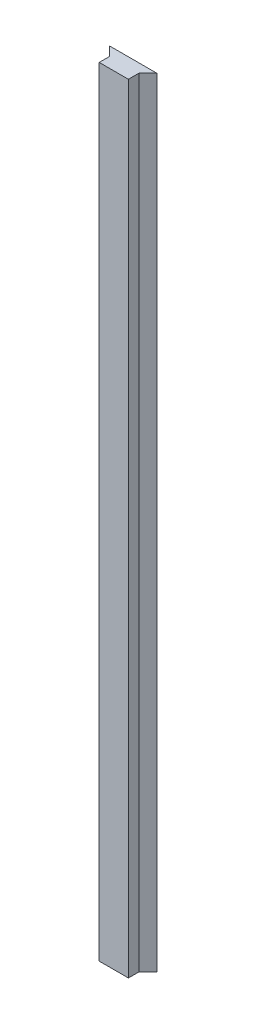
ISO-10303-21;
HEADER;
FILE_DESCRIPTION(('STEP AP214'),'2;1');
FILE_NAME('part.step','',(''),(''),'','','');
FILE_SCHEMA(('AUTOMOTIVE_DESIGN { 1 0 10303 214 1 1 1 1 }'));
ENDSEC;
DATA;
#1=APPLICATION_CONTEXT('core data for automotive mechanical design processes');
#2=APPLICATION_PROTOCOL_DEFINITION('international standard','automotive_design',2000,#1);
#3=PRODUCT_CONTEXT('',#1,'mechanical');
#4=PRODUCT('Part','Part','',(#3));
#5=PRODUCT_RELATED_PRODUCT_CATEGORY('part','',(#4));
#6=PRODUCT_DEFINITION_FORMATION('','',#4);
#7=PRODUCT_DEFINITION_CONTEXT('part definition',#1,'design');
#8=PRODUCT_DEFINITION('design','',#6,#7);
#9=PRODUCT_DEFINITION_SHAPE('','',#8);
#10=(LENGTH_UNIT() NAMED_UNIT(*) SI_UNIT(.MILLI.,.METRE.));
#11=(NAMED_UNIT(*) PLANE_ANGLE_UNIT() SI_UNIT($,.RADIAN.));
#12=(NAMED_UNIT(*) SI_UNIT($,.STERADIAN.) SOLID_ANGLE_UNIT());
#13=UNCERTAINTY_MEASURE_WITH_UNIT(LENGTH_MEASURE(1.E-05),#10,'distance_accuracy_value','');
#14=(GEOMETRIC_REPRESENTATION_CONTEXT(3) GLOBAL_UNCERTAINTY_ASSIGNED_CONTEXT((#13)) GLOBAL_UNIT_ASSIGNED_CONTEXT((#10,
#11,#12)) REPRESENTATION_CONTEXT('',''));
#15=CARTESIAN_POINT('',(0.,0.,0.));
#16=DIRECTION('',(0.,0.,1.));
#17=DIRECTION('',(1.,0.,0.));
#18=AXIS2_PLACEMENT_3D('',#15,#16,#17);
#19=CARTESIAN_POINT('',(0.,508.,-6.858));
#20=DIRECTION('',(1.,0.,0.));
#21=DIRECTION('',(0.,0.,-1.));
#22=AXIS2_PLACEMENT_3D('',#19,#20,#21);
#23=PLANE('',#22);
#24=DIRECTION('',(0.,0.,1.));
#25=VECTOR('',#24,1.);
#26=CARTESIAN_POINT('',(0.,0.,-6.858));
#27=LINE('',#26,#25);
#28=CARTESIAN_POINT('',(0.,0.,-6.858));
#29=VERTEX_POINT('',#28);
#30=CARTESIAN_POINT('',(0.,0.,0.));
#31=VERTEX_POINT('',#30);
#32=EDGE_CURVE('E117',#29,#31,#27,.T.);
#33=ORIENTED_EDGE('',*,*,#32,.T.);
#34=DIRECTION('',(0.,-1.,0.));
#35=VECTOR('',#34,1.);
#36=CARTESIAN_POINT('',(0.,508.,0.));
#37=LINE('',#36,#35);
#38=CARTESIAN_POINT('',(0.,508.,0.));
#39=VERTEX_POINT('',#38);
#40=EDGE_CURVE('E11',#39,#31,#37,.T.);
#41=ORIENTED_EDGE('',*,*,#40,.F.);
#42=DIRECTION('',(0.,0.,1.));
#43=VECTOR('',#42,1.);
#44=CARTESIAN_POINT('',(0.,508.,-6.858));
#45=LINE('',#44,#43);
#46=CARTESIAN_POINT('',(0.,508.,-6.858));
#47=VERTEX_POINT('',#46);
#48=EDGE_CURVE('E127',#47,#39,#45,.T.);
#49=ORIENTED_EDGE('',*,*,#48,.F.);
#50=DIRECTION('',(0.,-1.,0.));
#51=VECTOR('',#50,1.);
#52=CARTESIAN_POINT('',(0.,508.,-6.858));
#53=LINE('',#52,#51);
#54=EDGE_CURVE('E113',#47,#29,#53,.T.);
#55=ORIENTED_EDGE('',*,*,#54,.T.);
#56=EDGE_LOOP('',(#33,#41,#49,#55));
#57=FACE_BOUND('',#56,.T.);
#58=ADVANCED_FACE('F33',(#57),#23,.F.);
#59=CARTESIAN_POINT('',(0.,508.,0.));
#60=DIRECTION('',(0.,0.,-1.));
#61=DIRECTION('',(-1.,0.,0.));
#62=AXIS2_PLACEMENT_3D('',#59,#60,#61);
#63=PLANE('',#62);
#64=DIRECTION('',(1.,0.,0.));
#65=VECTOR('',#64,1.);
#66=CARTESIAN_POINT('',(0.,0.,0.));
#67=LINE('',#66,#65);
#68=CARTESIAN_POINT('',(19.05,0.,0.));
#69=VERTEX_POINT('',#68);
#70=EDGE_CURVE('E120',#31,#69,#67,.T.);
#71=ORIENTED_EDGE('',*,*,#70,.T.);
#72=DIRECTION('',(0.,-1.,0.));
#73=VECTOR('',#72,1.);
#74=CARTESIAN_POINT('',(19.05,508.,0.));
#75=LINE('',#74,#73);
#76=CARTESIAN_POINT('',(19.05,508.,0.));
#77=VERTEX_POINT('',#76);
#78=EDGE_CURVE('E41',#77,#69,#75,.T.);
#79=ORIENTED_EDGE('',*,*,#78,.F.);
#80=DIRECTION('',(1.,0.,0.));
#81=VECTOR('',#80,1.);
#82=CARTESIAN_POINT('',(0.,508.,0.));
#83=LINE('',#82,#81);
#84=EDGE_CURVE('E86',#39,#77,#83,.T.);
#85=ORIENTED_EDGE('',*,*,#84,.F.);
#86=ORIENTED_EDGE('',*,*,#40,.T.);
#87=EDGE_LOOP('',(#71,#79,#85,#86));
#88=FACE_BOUND('',#87,.T.);
#89=ADVANCED_FACE('F151',(#88),#63,.F.);
#90=CARTESIAN_POINT('',(19.05,508.,0.));
#91=DIRECTION('',(-1.,0.,0.));
#92=DIRECTION('',(0.,0.,1.));
#93=AXIS2_PLACEMENT_3D('',#90,#91,#92);
#94=PLANE('',#93);
#95=DIRECTION('',(0.,0.,-1.));
#96=VECTOR('',#95,1.);
#97=CARTESIAN_POINT('',(19.05,0.,0.));
#98=LINE('',#97,#96);
#99=CARTESIAN_POINT('',(19.05,0.,-6.858));
#100=VERTEX_POINT('',#99);
#101=EDGE_CURVE('E122',#69,#100,#98,.T.);
#102=ORIENTED_EDGE('',*,*,#101,.T.);
#103=DIRECTION('',(0.,-1.,0.));
#104=VECTOR('',#103,1.);
#105=CARTESIAN_POINT('',(19.05,508.,-6.858));
#106=LINE('',#105,#104);
#107=CARTESIAN_POINT('',(19.05,508.,-6.858));
#108=VERTEX_POINT('',#107);
#109=EDGE_CURVE('E108',#108,#100,#106,.T.);
#110=ORIENTED_EDGE('',*,*,#109,.F.);
#111=DIRECTION('',(0.,0.,-1.));
#112=VECTOR('',#111,1.);
#113=CARTESIAN_POINT('',(19.05,508.,0.));
#114=LINE('',#113,#112);
#115=EDGE_CURVE('E99',#77,#108,#114,.T.);
#116=ORIENTED_EDGE('',*,*,#115,.F.);
#117=ORIENTED_EDGE('',*,*,#78,.T.);
#118=EDGE_LOOP('',(#102,#110,#116,#117));
#119=FACE_BOUND('',#118,.T.);
#120=ADVANCED_FACE('F133',(#119),#94,.F.);
#121=CARTESIAN_POINT('',(19.05,508.,-6.858));
#122=DIRECTION('',(-0.707106781186557,0.,-0.707106781186538));
#123=DIRECTION('',(-0.707106781186538,0.,0.707106781186557));
#124=AXIS2_PLACEMENT_3D('',#121,#122,#123);
#125=PLANE('',#124);
#126=DIRECTION('',(0.707106781186538,0.,-0.707106781186557));
#127=VECTOR('',#126,1.);
#128=CARTESIAN_POINT('',(19.05,0.,-6.858));
#129=LINE('',#128,#127);
#130=CARTESIAN_POINT('',(24.8919999999998,0.,-12.7));
#131=VERTEX_POINT('',#130);
#132=EDGE_CURVE('E107',#100,#131,#129,.T.);
#133=ORIENTED_EDGE('',*,*,#132,.T.);
#134=DIRECTION('',(0.,-1.,0.));
#135=VECTOR('',#134,1.);
#136=CARTESIAN_POINT('',(24.8919999999998,508.,-12.7));
#137=LINE('',#136,#135);
#138=CARTESIAN_POINT('',(24.8919999999998,508.,-12.7));
#139=VERTEX_POINT('',#138);
#140=EDGE_CURVE('E104',#139,#131,#137,.T.);
#141=ORIENTED_EDGE('',*,*,#140,.F.);
#142=DIRECTION('',(0.707106781186538,0.,-0.707106781186557));
#143=VECTOR('',#142,1.);
#144=CARTESIAN_POINT('',(19.05,508.,-6.858));
#145=LINE('',#144,#143);
#146=EDGE_CURVE('E93',#108,#139,#145,.T.);
#147=ORIENTED_EDGE('',*,*,#146,.F.);
#148=ORIENTED_EDGE('',*,*,#109,.T.);
#149=EDGE_LOOP('',(#133,#141,#147,#148));
#150=FACE_BOUND('',#149,.T.);
#151=ADVANCED_FACE('F105',(#150),#125,.F.);
#152=CARTESIAN_POINT('',(24.8919999999998,508.,-12.7));
#153=DIRECTION('',(0.,0.,1.));
#154=DIRECTION('',(1.,0.,0.));
#155=AXIS2_PLACEMENT_3D('',#152,#153,#154);
#156=PLANE('',#155);
#157=DIRECTION('',(-1.,0.,0.));
#158=VECTOR('',#157,1.);
#159=CARTESIAN_POINT('',(24.8919999999998,0.,-12.7));
#160=LINE('',#159,#158);
#161=CARTESIAN_POINT('',(-5.84200000000015,0.,-12.7));
#162=VERTEX_POINT('',#161);
#163=EDGE_CURVE('E72',#131,#162,#160,.T.);
#164=ORIENTED_EDGE('',*,*,#163,.T.);
#165=DIRECTION('',(0.,-1.,0.));
#166=VECTOR('',#165,1.);
#167=CARTESIAN_POINT('',(-5.84200000000015,508.,-12.7));
#168=LINE('',#167,#166);
#169=CARTESIAN_POINT('',(-5.84200000000015,508.,-12.7));
#170=VERTEX_POINT('',#169);
#171=EDGE_CURVE('E109',#170,#162,#168,.T.);
#172=ORIENTED_EDGE('',*,*,#171,.F.);
#173=DIRECTION('',(-1.,0.,0.));
#174=VECTOR('',#173,1.);
#175=CARTESIAN_POINT('',(24.8919999999998,508.,-12.7));
#176=LINE('',#175,#174);
#177=EDGE_CURVE('E97',#139,#170,#176,.T.);
#178=ORIENTED_EDGE('',*,*,#177,.F.);
#179=ORIENTED_EDGE('',*,*,#140,.T.);
#180=EDGE_LOOP('',(#164,#172,#178,#179));
#181=FACE_BOUND('',#180,.T.);
#182=ADVANCED_FACE('F111',(#181),#156,.F.);
#183=CARTESIAN_POINT('',(-5.84200000000015,508.,-12.7));
#184=DIRECTION('',(0.707106781186538,0.,-0.707106781186557));
#185=DIRECTION('',(-0.707106781186557,0.,-0.707106781186538));
#186=AXIS2_PLACEMENT_3D('',#183,#184,#185);
#187=PLANE('',#186);
#188=DIRECTION('',(0.707106781186557,0.,0.707106781186538));
#189=VECTOR('',#188,1.);
#190=CARTESIAN_POINT('',(-5.84200000000015,0.,-12.7));
#191=LINE('',#190,#189);
#192=EDGE_CURVE('E78',#162,#29,#191,.T.);
#193=ORIENTED_EDGE('',*,*,#192,.T.);
#194=ORIENTED_EDGE('',*,*,#54,.F.);
#195=DIRECTION('',(0.707106781186557,0.,0.707106781186538));
#196=VECTOR('',#195,1.);
#197=CARTESIAN_POINT('',(-5.84200000000015,508.,-12.7));
#198=LINE('',#197,#196);
#199=EDGE_CURVE('E49',#170,#47,#198,.T.);
#200=ORIENTED_EDGE('',*,*,#199,.F.);
#201=ORIENTED_EDGE('',*,*,#171,.T.);
#202=EDGE_LOOP('',(#193,#194,#200,#201));
#203=FACE_BOUND('',#202,.T.);
#204=ADVANCED_FACE('F140',(#203),#187,.F.);
#205=CARTESIAN_POINT('',(0.,508.,0.));
#206=DIRECTION('',(0.,1.,0.));
#207=DIRECTION('',(0.,0.,1.));
#208=AXIS2_PLACEMENT_3D('',#205,#206,#207);
#209=PLANE('',#208);
#210=ORIENTED_EDGE('',*,*,#48,.T.);
#211=ORIENTED_EDGE('',*,*,#84,.T.);
#212=ORIENTED_EDGE('',*,*,#115,.T.);
#213=ORIENTED_EDGE('',*,*,#146,.T.);
#214=ORIENTED_EDGE('',*,*,#177,.T.);
#215=ORIENTED_EDGE('',*,*,#199,.T.);
#216=EDGE_LOOP('',(#210,#211,#212,#213,#214,#215));
#217=FACE_BOUND('',#216,.T.);
#218=ADVANCED_FACE('F95',(#217),#209,.T.);
#219=CARTESIAN_POINT('',(0.,0.,0.));
#220=DIRECTION('',(0.,1.,0.));
#221=DIRECTION('',(0.,0.,1.));
#222=AXIS2_PLACEMENT_3D('',#219,#220,#221);
#223=PLANE('',#222);
#224=ORIENTED_EDGE('',*,*,#32,.F.);
#225=ORIENTED_EDGE('',*,*,#192,.F.);
#226=ORIENTED_EDGE('',*,*,#163,.F.);
#227=ORIENTED_EDGE('',*,*,#132,.F.);
#228=ORIENTED_EDGE('',*,*,#101,.F.);
#229=ORIENTED_EDGE('',*,*,#70,.F.);
#230=EDGE_LOOP('',(#224,#225,#226,#227,#228,#229));
#231=FACE_BOUND('',#230,.T.);
#232=ADVANCED_FACE('F136',(#231),#223,.F.);
#233=CLOSED_SHELL('',(#58,#89,#120,#151,#182,#204,#218,#232));
#234=MANIFOLD_SOLID_BREP('B2',#233);
#235=ADVANCED_BREP_SHAPE_REPRESENTATION('',(#18,#234),#14);
#236=SHAPE_DEFINITION_REPRESENTATION(#9,#235);
ENDSEC;
END-ISO-10303-21;
